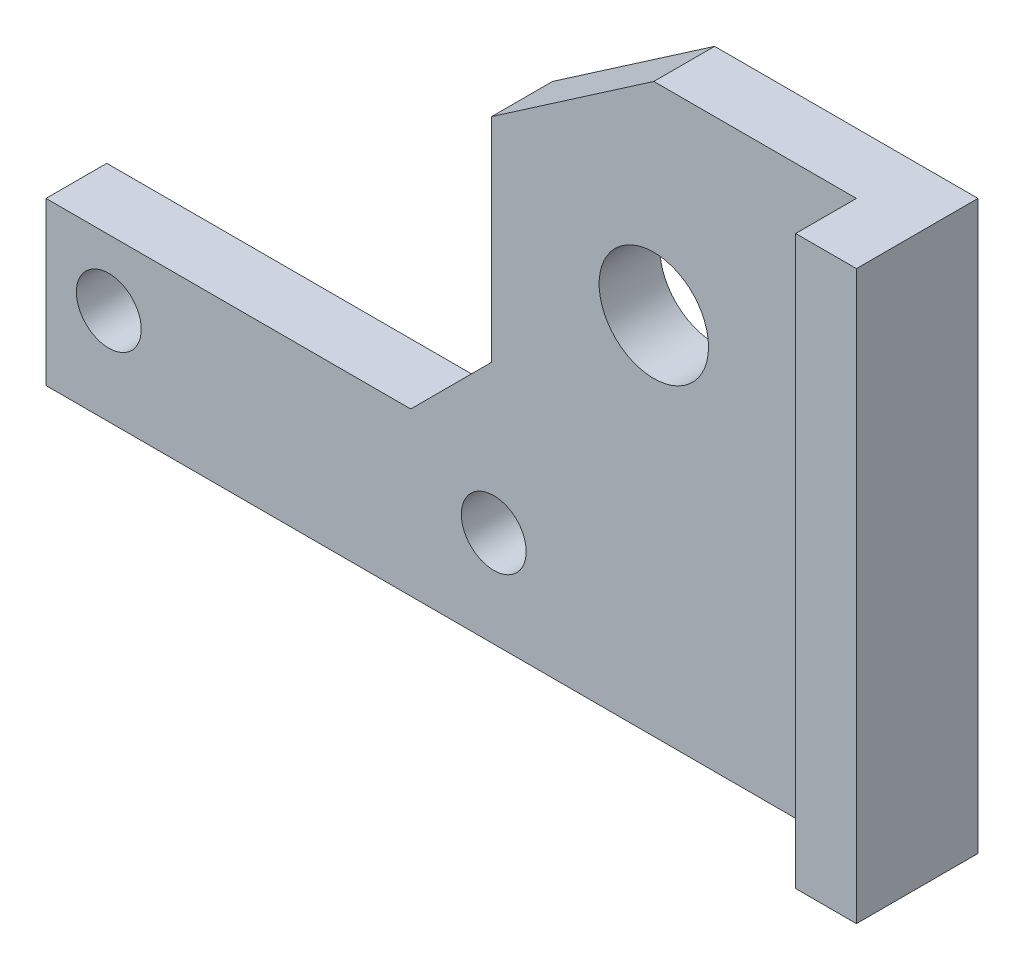
ISO-10303-21;
HEADER;
FILE_DESCRIPTION(('STEP AP214'),'2;1');
FILE_NAME('part.step','',(''),(''),'','','');
FILE_SCHEMA(('AUTOMOTIVE_DESIGN { 1 0 10303 214 1 1 1 1 }'));
ENDSEC;
DATA;
#1=APPLICATION_CONTEXT('core data for automotive mechanical design processes');
#2=APPLICATION_PROTOCOL_DEFINITION('international standard','automotive_design',2000,#1);
#3=PRODUCT_CONTEXT('',#1,'mechanical');
#4=PRODUCT('Part','Part','',(#3));
#5=PRODUCT_RELATED_PRODUCT_CATEGORY('part','',(#4));
#6=PRODUCT_DEFINITION_FORMATION('','',#4);
#7=PRODUCT_DEFINITION_CONTEXT('part definition',#1,'design');
#8=PRODUCT_DEFINITION('design','',#6,#7);
#9=PRODUCT_DEFINITION_SHAPE('','',#8);
#10=(LENGTH_UNIT() NAMED_UNIT(*) SI_UNIT(.MILLI.,.METRE.));
#11=(NAMED_UNIT(*) PLANE_ANGLE_UNIT() SI_UNIT($,.RADIAN.));
#12=(NAMED_UNIT(*) SI_UNIT($,.STERADIAN.) SOLID_ANGLE_UNIT());
#13=UNCERTAINTY_MEASURE_WITH_UNIT(LENGTH_MEASURE(1.E-05),#10,'distance_accuracy_value','');
#14=(GEOMETRIC_REPRESENTATION_CONTEXT(3) GLOBAL_UNCERTAINTY_ASSIGNED_CONTEXT((#13)) GLOBAL_UNIT_ASSIGNED_CONTEXT((#10,
#11,#12)) REPRESENTATION_CONTEXT('',''));
#15=CARTESIAN_POINT('',(0.,0.,0.));
#16=DIRECTION('',(0.,0.,1.));
#17=DIRECTION('',(1.,0.,0.));
#18=AXIS2_PLACEMENT_3D('',#15,#16,#17);
#19=CARTESIAN_POINT('',(0.,0.,3.));
#20=DIRECTION('',(0.,0.,-1.));
#21=DIRECTION('',(-1.,0.,0.));
#22=AXIS2_PLACEMENT_3D('',#19,#20,#21);
#23=PLANE('',#22);
#24=CARTESIAN_POINT('',(-39.9,4.75,3.));
#25=DIRECTION('',(0.,0.,1.));
#26=DIRECTION('',(1.,0.,0.));
#27=AXIS2_PLACEMENT_3D('',#24,#25,#26);
#28=CIRCLE('',#27,1.6);
#29=CARTESIAN_POINT('',(-38.3,4.75,3.));
#30=VERTEX_POINT('',#29);
#31=EDGE_CURVE('E260',#30,#30,#28,.T.);
#32=ORIENTED_EDGE('',*,*,#31,.F.);
#33=EDGE_LOOP('',(#32));
#34=FACE_BOUND('',#33,.T.);
#35=CARTESIAN_POINT('',(-13.,18.,3.));
#36=DIRECTION('',(0.,0.,1.));
#37=DIRECTION('',(1.,0.,0.));
#38=AXIS2_PLACEMENT_3D('',#35,#36,#37);
#39=CIRCLE('',#38,2.7);
#40=CARTESIAN_POINT('',(-10.3,18.,3.));
#41=VERTEX_POINT('',#40);
#42=EDGE_CURVE('E287',#41,#41,#39,.T.);
#43=ORIENTED_EDGE('',*,*,#42,.F.);
#44=EDGE_LOOP('',(#43));
#45=FACE_BOUND('',#44,.T.);
#46=CARTESIAN_POINT('',(-20.9,4.75,3.));
#47=DIRECTION('',(0.,0.,1.));
#48=DIRECTION('',(1.,0.,0.));
#49=AXIS2_PLACEMENT_3D('',#46,#47,#48);
#50=CIRCLE('',#49,1.6);
#51=CARTESIAN_POINT('',(-19.3,4.75,3.));
#52=VERTEX_POINT('',#51);
#53=EDGE_CURVE('E281',#52,#52,#50,.T.);
#54=ORIENTED_EDGE('',*,*,#53,.F.);
#55=EDGE_LOOP('',(#54));
#56=FACE_BOUND('',#55,.T.);
#57=DIRECTION('',(0.,-1.,0.));
#58=VECTOR('',#57,1.);
#59=CARTESIAN_POINT('',(-3.,0.,3.));
#60=LINE('',#59,#58);
#61=CARTESIAN_POINT('',(-3.,28.,3.));
#62=VERTEX_POINT('',#61);
#63=CARTESIAN_POINT('',(-3.,0.,3.));
#64=VERTEX_POINT('',#63);
#65=EDGE_CURVE('E140',#62,#64,#60,.T.);
#66=ORIENTED_EDGE('',*,*,#65,.F.);
#67=DIRECTION('',(1.,0.,0.));
#68=VECTOR('',#67,1.);
#69=CARTESIAN_POINT('',(-13.,28.,3.));
#70=LINE('',#69,#68);
#71=CARTESIAN_POINT('',(-13.,28.,3.));
#72=VERTEX_POINT('',#71);
#73=EDGE_CURVE('E264',#72,#62,#70,.T.);
#74=ORIENTED_EDGE('',*,*,#73,.F.);
#75=DIRECTION('',(-0.824041924199368,-0.566528822887065,0.));
#76=VECTOR('',#75,1.);
#77=CARTESIAN_POINT('',(-13.,28.,3.));
#78=LINE('',#77,#76);
#79=CARTESIAN_POINT('',(-21.,22.5,3.));
#80=VERTEX_POINT('',#79);
#81=EDGE_CURVE('E293',#72,#80,#78,.T.);
#82=ORIENTED_EDGE('',*,*,#81,.T.);
#83=DIRECTION('',(0.,1.,0.));
#84=VECTOR('',#83,1.);
#85=CARTESIAN_POINT('',(-21.,12.,3.));
#86=LINE('',#85,#84);
#87=CARTESIAN_POINT('',(-21.,12.,3.));
#88=VERTEX_POINT('',#87);
#89=EDGE_CURVE('E295',#88,#80,#86,.T.);
#90=ORIENTED_EDGE('',*,*,#89,.F.);
#91=DIRECTION('',(0.707106781186547,0.707106781186548,0.));
#92=VECTOR('',#91,1.);
#93=CARTESIAN_POINT('',(-25.,8.,3.));
#94=LINE('',#93,#92);
#95=CARTESIAN_POINT('',(-25.,8.,3.));
#96=VERTEX_POINT('',#95);
#97=EDGE_CURVE('E299',#96,#88,#94,.T.);
#98=ORIENTED_EDGE('',*,*,#97,.F.);
#99=DIRECTION('',(1.,0.,0.));
#100=VECTOR('',#99,1.);
#101=CARTESIAN_POINT('',(-43.,8.,3.));
#102=LINE('',#101,#100);
#103=CARTESIAN_POINT('',(-43.,8.,3.));
#104=VERTEX_POINT('',#103);
#105=EDGE_CURVE('E302',#104,#96,#102,.T.);
#106=ORIENTED_EDGE('',*,*,#105,.F.);
#107=DIRECTION('',(0.,1.,0.));
#108=VECTOR('',#107,1.);
#109=CARTESIAN_POINT('',(-43.,0.,3.));
#110=LINE('',#109,#108);
#111=CARTESIAN_POINT('',(-43.,0.,3.));
#112=VERTEX_POINT('',#111);
#113=EDGE_CURVE('E306',#112,#104,#110,.T.);
#114=ORIENTED_EDGE('',*,*,#113,.F.);
#115=DIRECTION('',(1.,0.,0.));
#116=VECTOR('',#115,1.);
#117=CARTESIAN_POINT('',(-43.,0.,3.));
#118=LINE('',#117,#116);
#119=EDGE_CURVE('E309',#112,#64,#118,.T.);
#120=ORIENTED_EDGE('',*,*,#119,.T.);
#121=EDGE_LOOP('',(#66,#74,#82,#90,#98,#106,#114,#120));
#122=FACE_BOUND('',#121,.T.);
#123=ADVANCED_FACE('F115',(#34,#45,#56,#122),#23,.F.);
#124=CARTESIAN_POINT('',(0.,0.,0.));
#125=DIRECTION('',(0.,0.,-1.));
#126=DIRECTION('',(-1.,0.,0.));
#127=AXIS2_PLACEMENT_3D('',#124,#125,#126);
#128=PLANE('',#127);
#129=DIRECTION('',(0.,1.,0.));
#130=VECTOR('',#129,1.);
#131=CARTESIAN_POINT('',(-16.5,0.,0.));
#132=LINE('',#131,#130);
#133=CARTESIAN_POINT('',(-16.5,0.,0.));
#134=VERTEX_POINT('',#133);
#135=CARTESIAN_POINT('',(-16.5,12.,0.));
#136=VERTEX_POINT('',#135);
#137=EDGE_CURVE('E392',#134,#136,#132,.T.);
#138=ORIENTED_EDGE('',*,*,#137,.F.);
#139=DIRECTION('',(1.,0.,0.));
#140=VECTOR('',#139,1.);
#141=CARTESIAN_POINT('',(-43.,0.,0.));
#142=LINE('',#141,#140);
#143=CARTESIAN_POINT('',(-43.,0.,0.));
#144=VERTEX_POINT('',#143);
#145=EDGE_CURVE('E238',#144,#134,#142,.T.);
#146=ORIENTED_EDGE('',*,*,#145,.F.);
#147=DIRECTION('',(0.,1.,0.));
#148=VECTOR('',#147,1.);
#149=CARTESIAN_POINT('',(-43.,0.,0.));
#150=LINE('',#149,#148);
#151=CARTESIAN_POINT('',(-43.,8.,0.));
#152=VERTEX_POINT('',#151);
#153=EDGE_CURVE('E336',#144,#152,#150,.T.);
#154=ORIENTED_EDGE('',*,*,#153,.T.);
#155=DIRECTION('',(1.,0.,0.));
#156=VECTOR('',#155,1.);
#157=CARTESIAN_POINT('',(-43.,8.,0.));
#158=LINE('',#157,#156);
#159=CARTESIAN_POINT('',(-25.,8.,0.));
#160=VERTEX_POINT('',#159);
#161=EDGE_CURVE('E339',#152,#160,#158,.T.);
#162=ORIENTED_EDGE('',*,*,#161,.T.);
#163=DIRECTION('',(0.707106781186547,0.707106781186548,0.));
#164=VECTOR('',#163,1.);
#165=CARTESIAN_POINT('',(-25.,8.,0.));
#166=LINE('',#165,#164);
#167=CARTESIAN_POINT('',(-21.,12.,0.));
#168=VERTEX_POINT('',#167);
#169=EDGE_CURVE('E342',#160,#168,#166,.T.);
#170=ORIENTED_EDGE('',*,*,#169,.T.);
#171=DIRECTION('',(0.,1.,0.));
#172=VECTOR('',#171,1.);
#173=CARTESIAN_POINT('',(-21.,12.,0.));
#174=LINE('',#173,#172);
#175=CARTESIAN_POINT('',(-21.,22.5,0.));
#176=VERTEX_POINT('',#175);
#177=EDGE_CURVE('E345',#168,#176,#174,.T.);
#178=ORIENTED_EDGE('',*,*,#177,.T.);
#179=DIRECTION('',(-0.824041924199368,-0.566528822887065,0.));
#180=VECTOR('',#179,1.);
#181=CARTESIAN_POINT('',(-13.,28.,0.));
#182=LINE('',#181,#180);
#183=CARTESIAN_POINT('',(-13.,28.,0.));
#184=VERTEX_POINT('',#183);
#185=EDGE_CURVE('E290',#184,#176,#182,.T.);
#186=ORIENTED_EDGE('',*,*,#185,.F.);
#187=DIRECTION('',(1.,0.,0.));
#188=VECTOR('',#187,1.);
#189=CARTESIAN_POINT('',(-13.,28.,0.));
#190=LINE('',#189,#188);
#191=CARTESIAN_POINT('',(0.,28.,0.));
#192=VERTEX_POINT('',#191);
#193=EDGE_CURVE('E296',#184,#192,#190,.T.);
#194=ORIENTED_EDGE('',*,*,#193,.T.);
#195=DIRECTION('',(0.,1.,0.));
#196=VECTOR('',#195,1.);
#197=CARTESIAN_POINT('',(0.,0.,0.));
#198=LINE('',#197,#196);
#199=CARTESIAN_POINT('',(0.,0.,0.));
#200=VERTEX_POINT('',#199);
#201=EDGE_CURVE('E331',#200,#192,#198,.T.);
#202=ORIENTED_EDGE('',*,*,#201,.F.);
#203=CARTESIAN_POINT('',(-13.5,0.,0.));
#204=VERTEX_POINT('',#203);
#205=EDGE_CURVE('E335',#204,#200,#142,.T.);
#206=ORIENTED_EDGE('',*,*,#205,.F.);
#207=DIRECTION('',(0.,-1.,0.));
#208=VECTOR('',#207,1.);
#209=CARTESIAN_POINT('',(-13.5,0.,0.));
#210=LINE('',#209,#208);
#211=CARTESIAN_POINT('',(-13.5,12.,0.));
#212=VERTEX_POINT('',#211);
#213=EDGE_CURVE('E388',#212,#204,#210,.T.);
#214=ORIENTED_EDGE('',*,*,#213,.F.);
#215=DIRECTION('',(1.,0.,0.));
#216=VECTOR('',#215,1.);
#217=CARTESIAN_POINT('',(0.,12.,0.));
#218=LINE('',#217,#216);
#219=EDGE_CURVE('E233',#136,#212,#218,.T.);
#220=ORIENTED_EDGE('',*,*,#219,.F.);
#221=EDGE_LOOP('',(#138,#146,#154,#162,#170,#178,#186,#194,#202,#206,#214,#220));
#222=FACE_BOUND('',#221,.T.);
#223=CARTESIAN_POINT('',(-20.9,4.75,0.));
#224=DIRECTION('',(0.,0.,1.));
#225=DIRECTION('',(1.,0.,0.));
#226=AXIS2_PLACEMENT_3D('',#223,#224,#225);
#227=CIRCLE('',#226,1.6);
#228=CARTESIAN_POINT('',(-19.3,4.75,0.));
#229=VERTEX_POINT('',#228);
#230=EDGE_CURVE('E279',#229,#229,#227,.T.);
#231=ORIENTED_EDGE('',*,*,#230,.T.);
#232=EDGE_LOOP('',(#231));
#233=FACE_BOUND('',#232,.T.);
#234=CARTESIAN_POINT('',(-13.,18.,0.));
#235=DIRECTION('',(0.,0.,1.));
#236=DIRECTION('',(1.,0.,0.));
#237=AXIS2_PLACEMENT_3D('',#234,#235,#236);
#238=CIRCLE('',#237,2.7);
#239=CARTESIAN_POINT('',(-10.3,18.,0.));
#240=VERTEX_POINT('',#239);
#241=EDGE_CURVE('E284',#240,#240,#238,.T.);
#242=ORIENTED_EDGE('',*,*,#241,.T.);
#243=EDGE_LOOP('',(#242));
#244=FACE_BOUND('',#243,.T.);
#245=CARTESIAN_POINT('',(-39.9,4.75,0.));
#246=DIRECTION('',(0.,0.,1.));
#247=DIRECTION('',(1.,0.,0.));
#248=AXIS2_PLACEMENT_3D('',#245,#246,#247);
#249=CIRCLE('',#248,1.6);
#250=CARTESIAN_POINT('',(-38.3,4.75,0.));
#251=VERTEX_POINT('',#250);
#252=EDGE_CURVE('E272',#251,#251,#249,.T.);
#253=ORIENTED_EDGE('',*,*,#252,.T.);
#254=EDGE_LOOP('',(#253));
#255=FACE_BOUND('',#254,.T.);
#256=ADVANCED_FACE('F355',(#222,#233,#244,#255),#128,.T.);
#257=CARTESIAN_POINT('',(-13.,28.,3.));
#258=DIRECTION('',(0.566528822887065,-0.824041924199368,0.));
#259=DIRECTION('',(0.824041924199368,0.566528822887065,0.));
#260=AXIS2_PLACEMENT_3D('',#257,#258,#259);
#261=PLANE('',#260);
#262=ORIENTED_EDGE('',*,*,#185,.T.);
#263=DIRECTION('',(0.,0.,-1.));
#264=VECTOR('',#263,1.);
#265=CARTESIAN_POINT('',(-21.,22.5,3.));
#266=LINE('',#265,#264);
#267=EDGE_CURVE('E12',#80,#176,#266,.T.);
#268=ORIENTED_EDGE('',*,*,#267,.F.);
#269=ORIENTED_EDGE('',*,*,#81,.F.);
#270=DIRECTION('',(0.,0.,-1.));
#271=VECTOR('',#270,1.);
#272=CARTESIAN_POINT('',(-13.,28.,3.));
#273=LINE('',#272,#271);
#274=EDGE_CURVE('E326',#72,#184,#273,.T.);
#275=ORIENTED_EDGE('',*,*,#274,.T.);
#276=EDGE_LOOP('',(#262,#268,#269,#275));
#277=FACE_BOUND('',#276,.T.);
#278=ADVANCED_FACE('F117',(#277),#261,.F.);
#279=CARTESIAN_POINT('',(-21.,12.,3.));
#280=DIRECTION('',(-1.,0.,0.));
#281=DIRECTION('',(0.,0.,1.));
#282=AXIS2_PLACEMENT_3D('',#279,#280,#281);
#283=PLANE('',#282);
#284=ORIENTED_EDGE('',*,*,#177,.F.);
#285=DIRECTION('',(0.,0.,-1.));
#286=VECTOR('',#285,1.);
#287=CARTESIAN_POINT('',(-21.,12.,3.));
#288=LINE('',#287,#286);
#289=EDGE_CURVE('E124',#88,#168,#288,.T.);
#290=ORIENTED_EDGE('',*,*,#289,.F.);
#291=ORIENTED_EDGE('',*,*,#89,.T.);
#292=ORIENTED_EDGE('',*,*,#267,.T.);
#293=EDGE_LOOP('',(#284,#290,#291,#292));
#294=FACE_BOUND('',#293,.T.);
#295=ADVANCED_FACE('F359',(#294),#283,.T.);
#296=CARTESIAN_POINT('',(-25.,8.,3.));
#297=DIRECTION('',(-0.707106781186548,0.707106781186547,0.));
#298=DIRECTION('',(-0.707106781186547,-0.707106781186548,0.));
#299=AXIS2_PLACEMENT_3D('',#296,#297,#298);
#300=PLANE('',#299);
#301=ORIENTED_EDGE('',*,*,#169,.F.);
#302=DIRECTION('',(0.,0.,-1.));
#303=VECTOR('',#302,1.);
#304=CARTESIAN_POINT('',(-25.,8.,3.));
#305=LINE('',#304,#303);
#306=EDGE_CURVE('E315',#96,#160,#305,.T.);
#307=ORIENTED_EDGE('',*,*,#306,.F.);
#308=ORIENTED_EDGE('',*,*,#97,.T.);
#309=ORIENTED_EDGE('',*,*,#289,.T.);
#310=EDGE_LOOP('',(#301,#307,#308,#309));
#311=FACE_BOUND('',#310,.T.);
#312=ADVANCED_FACE('F364',(#311),#300,.T.);
#313=CARTESIAN_POINT('',(-43.,8.,3.));
#314=DIRECTION('',(0.,1.,0.));
#315=DIRECTION('',(0.,0.,1.));
#316=AXIS2_PLACEMENT_3D('',#313,#314,#315);
#317=PLANE('',#316);
#318=ORIENTED_EDGE('',*,*,#161,.F.);
#319=DIRECTION('',(0.,0.,-1.));
#320=VECTOR('',#319,1.);
#321=CARTESIAN_POINT('',(-43.,8.,3.));
#322=LINE('',#321,#320);
#323=EDGE_CURVE('E317',#104,#152,#322,.T.);
#324=ORIENTED_EDGE('',*,*,#323,.F.);
#325=ORIENTED_EDGE('',*,*,#105,.T.);
#326=ORIENTED_EDGE('',*,*,#306,.T.);
#327=EDGE_LOOP('',(#318,#324,#325,#326));
#328=FACE_BOUND('',#327,.T.);
#329=ADVANCED_FACE('F367',(#328),#317,.T.);
#330=CARTESIAN_POINT('',(-43.,0.,3.));
#331=DIRECTION('',(-1.,0.,0.));
#332=DIRECTION('',(0.,-1.,0.));
#333=AXIS2_PLACEMENT_3D('',#330,#331,#332);
#334=PLANE('',#333);
#335=ORIENTED_EDGE('',*,*,#153,.F.);
#336=DIRECTION('',(0.,0.,-1.));
#337=VECTOR('',#336,1.);
#338=CARTESIAN_POINT('',(-43.,0.,3.));
#339=LINE('',#338,#337);
#340=EDGE_CURVE('E319',#112,#144,#339,.T.);
#341=ORIENTED_EDGE('',*,*,#340,.F.);
#342=ORIENTED_EDGE('',*,*,#113,.T.);
#343=ORIENTED_EDGE('',*,*,#323,.T.);
#344=EDGE_LOOP('',(#335,#341,#342,#343));
#345=FACE_BOUND('',#344,.T.);
#346=ADVANCED_FACE('F371',(#345),#334,.T.);
#347=CARTESIAN_POINT('',(-43.,0.,3.));
#348=DIRECTION('',(0.,1.,0.));
#349=DIRECTION('',(0.,0.,1.));
#350=AXIS2_PLACEMENT_3D('',#347,#348,#349);
#351=PLANE('',#350);
#352=ORIENTED_EDGE('',*,*,#145,.T.);
#353=DIRECTION('',(0.,0.,-1.));
#354=VECTOR('',#353,1.);
#355=CARTESIAN_POINT('',(-16.5,0.,1.25));
#356=LINE('',#355,#354);
#357=CARTESIAN_POINT('',(-16.5,0.,1.25));
#358=VERTEX_POINT('',#357);
#359=EDGE_CURVE('E230',#358,#134,#356,.T.);
#360=ORIENTED_EDGE('',*,*,#359,.F.);
#361=DIRECTION('',(1.,0.,0.));
#362=VECTOR('',#361,1.);
#363=CARTESIAN_POINT('',(0.,0.,1.25));
#364=LINE('',#363,#362);
#365=CARTESIAN_POINT('',(-13.5,0.,1.25));
#366=VERTEX_POINT('',#365);
#367=EDGE_CURVE('E218',#358,#366,#364,.T.);
#368=ORIENTED_EDGE('',*,*,#367,.T.);
#369=DIRECTION('',(0.,0.,-1.));
#370=VECTOR('',#369,1.);
#371=CARTESIAN_POINT('',(-13.5,0.,1.25));
#372=LINE('',#371,#370);
#373=EDGE_CURVE('E239',#366,#204,#372,.T.);
#374=ORIENTED_EDGE('',*,*,#373,.T.);
#375=ORIENTED_EDGE('',*,*,#205,.T.);
#376=DIRECTION('',(0.,0.,-1.));
#377=VECTOR('',#376,1.);
#378=CARTESIAN_POINT('',(0.,0.,3.));
#379=LINE('',#378,#377);
#380=CARTESIAN_POINT('',(0.,0.,6.));
#381=VERTEX_POINT('',#380);
#382=EDGE_CURVE('E321',#381,#200,#379,.T.);
#383=ORIENTED_EDGE('',*,*,#382,.F.);
#384=DIRECTION('',(1.,0.,0.));
#385=VECTOR('',#384,1.);
#386=CARTESIAN_POINT('',(0.,0.,6.));
#387=LINE('',#386,#385);
#388=CARTESIAN_POINT('',(-3.,0.,6.));
#389=VERTEX_POINT('',#388);
#390=EDGE_CURVE('E254',#389,#381,#387,.T.);
#391=ORIENTED_EDGE('',*,*,#390,.F.);
#392=DIRECTION('',(0.,0.,-1.));
#393=VECTOR('',#392,1.);
#394=CARTESIAN_POINT('',(-3.,0.,6.));
#395=LINE('',#394,#393);
#396=EDGE_CURVE('E257',#389,#64,#395,.T.);
#397=ORIENTED_EDGE('',*,*,#396,.T.);
#398=ORIENTED_EDGE('',*,*,#119,.F.);
#399=ORIENTED_EDGE('',*,*,#340,.T.);
#400=EDGE_LOOP('',(#352,#360,#368,#374,#375,#383,#391,#397,#398,#399));
#401=FACE_BOUND('',#400,.T.);
#402=ADVANCED_FACE('F236',(#401),#351,.F.);
#403=CARTESIAN_POINT('',(0.,0.,3.));
#404=DIRECTION('',(-1.,0.,0.));
#405=DIRECTION('',(0.,0.,1.));
#406=AXIS2_PLACEMENT_3D('',#403,#404,#405);
#407=PLANE('',#406);
#408=ORIENTED_EDGE('',*,*,#201,.T.);
#409=DIRECTION('',(0.,0.,-1.));
#410=VECTOR('',#409,1.);
#411=CARTESIAN_POINT('',(0.,28.,3.));
#412=LINE('',#411,#410);
#413=CARTESIAN_POINT('',(0.,28.,6.));
#414=VERTEX_POINT('',#413);
#415=EDGE_CURVE('E324',#414,#192,#412,.T.);
#416=ORIENTED_EDGE('',*,*,#415,.F.);
#417=DIRECTION('',(0.,1.,0.));
#418=VECTOR('',#417,1.);
#419=CARTESIAN_POINT('',(0.,0.,6.));
#420=LINE('',#419,#418);
#421=EDGE_CURVE('E241',#381,#414,#420,.T.);
#422=ORIENTED_EDGE('',*,*,#421,.F.);
#423=ORIENTED_EDGE('',*,*,#382,.T.);
#424=EDGE_LOOP('',(#408,#416,#422,#423));
#425=FACE_BOUND('',#424,.T.);
#426=ADVANCED_FACE('F381',(#425),#407,.F.);
#427=CARTESIAN_POINT('',(-13.,28.,3.));
#428=DIRECTION('',(0.,1.,0.));
#429=DIRECTION('',(0.,0.,1.));
#430=AXIS2_PLACEMENT_3D('',#427,#428,#429);
#431=PLANE('',#430);
#432=ORIENTED_EDGE('',*,*,#193,.F.);
#433=ORIENTED_EDGE('',*,*,#274,.F.);
#434=ORIENTED_EDGE('',*,*,#73,.T.);
#435=DIRECTION('',(0.,0.,-1.));
#436=VECTOR('',#435,1.);
#437=CARTESIAN_POINT('',(-3.,28.,6.));
#438=LINE('',#437,#436);
#439=CARTESIAN_POINT('',(-3.,28.,6.));
#440=VERTEX_POINT('',#439);
#441=EDGE_CURVE('E269',#440,#62,#438,.T.);
#442=ORIENTED_EDGE('',*,*,#441,.F.);
#443=DIRECTION('',(1.,0.,0.));
#444=VECTOR('',#443,1.);
#445=CARTESIAN_POINT('',(0.,28.,6.));
#446=LINE('',#445,#444);
#447=EDGE_CURVE('E249',#440,#414,#446,.T.);
#448=ORIENTED_EDGE('',*,*,#447,.T.);
#449=ORIENTED_EDGE('',*,*,#415,.T.);
#450=EDGE_LOOP('',(#432,#433,#434,#442,#448,#449));
#451=FACE_BOUND('',#450,.T.);
#452=ADVANCED_FACE('F384',(#451),#431,.T.);
#453=CARTESIAN_POINT('',(-13.,18.,3.));
#454=DIRECTION('',(0.,0.,-1.));
#455=DIRECTION('',(-1.,0.,0.));
#456=AXIS2_PLACEMENT_3D('',#453,#454,#455);
#457=CYLINDRICAL_SURFACE('',#456,2.7);
#458=ORIENTED_EDGE('',*,*,#42,.T.);
#459=EDGE_LOOP('',(#458));
#460=FACE_BOUND('',#459,.T.);
#461=ORIENTED_EDGE('',*,*,#241,.F.);
#462=EDGE_LOOP('',(#461));
#463=FACE_BOUND('',#462,.T.);
#464=ADVANCED_FACE('F420',(#460,#463),#457,.F.);
#465=CARTESIAN_POINT('',(-20.9,4.75,3.));
#466=DIRECTION('',(0.,0.,-1.));
#467=DIRECTION('',(-1.,0.,0.));
#468=AXIS2_PLACEMENT_3D('',#465,#466,#467);
#469=CYLINDRICAL_SURFACE('',#468,1.6);
#470=ORIENTED_EDGE('',*,*,#53,.T.);
#471=EDGE_LOOP('',(#470));
#472=FACE_BOUND('',#471,.T.);
#473=ORIENTED_EDGE('',*,*,#230,.F.);
#474=EDGE_LOOP('',(#473));
#475=FACE_BOUND('',#474,.T.);
#476=ADVANCED_FACE('F464',(#472,#475),#469,.F.);
#477=CARTESIAN_POINT('',(-39.9,4.75,3.));
#478=DIRECTION('',(0.,0.,-1.));
#479=DIRECTION('',(-1.,0.,0.));
#480=AXIS2_PLACEMENT_3D('',#477,#478,#479);
#481=CYLINDRICAL_SURFACE('',#480,1.6);
#482=ORIENTED_EDGE('',*,*,#31,.T.);
#483=EDGE_LOOP('',(#482));
#484=FACE_BOUND('',#483,.T.);
#485=ORIENTED_EDGE('',*,*,#252,.F.);
#486=EDGE_LOOP('',(#485));
#487=FACE_BOUND('',#486,.T.);
#488=ADVANCED_FACE('F460',(#484,#487),#481,.F.);
#489=CARTESIAN_POINT('',(-3.,0.,6.));
#490=DIRECTION('',(1.,0.,0.));
#491=DIRECTION('',(0.,0.,-1.));
#492=AXIS2_PLACEMENT_3D('',#489,#490,#491);
#493=PLANE('',#492);
#494=ORIENTED_EDGE('',*,*,#65,.T.);
#495=ORIENTED_EDGE('',*,*,#396,.F.);
#496=DIRECTION('',(0.,-1.,0.));
#497=VECTOR('',#496,1.);
#498=CARTESIAN_POINT('',(-3.,0.,6.));
#499=LINE('',#498,#497);
#500=EDGE_CURVE('E252',#440,#389,#499,.T.);
#501=ORIENTED_EDGE('',*,*,#500,.F.);
#502=ORIENTED_EDGE('',*,*,#441,.T.);
#503=EDGE_LOOP('',(#494,#495,#501,#502));
#504=FACE_BOUND('',#503,.T.);
#505=ADVANCED_FACE('F375',(#504),#493,.F.);
#506=CARTESIAN_POINT('',(0.,0.,6.));
#507=DIRECTION('',(0.,0.,-1.));
#508=DIRECTION('',(-1.,0.,0.));
#509=AXIS2_PLACEMENT_3D('',#506,#507,#508);
#510=PLANE('',#509);
#511=ORIENTED_EDGE('',*,*,#421,.T.);
#512=ORIENTED_EDGE('',*,*,#447,.F.);
#513=ORIENTED_EDGE('',*,*,#500,.T.);
#514=ORIENTED_EDGE('',*,*,#390,.T.);
#515=EDGE_LOOP('',(#511,#512,#513,#514));
#516=FACE_BOUND('',#515,.T.);
#517=ADVANCED_FACE('F379',(#516),#510,.F.);
#518=CARTESIAN_POINT('',(-16.5,0.,1.25));
#519=DIRECTION('',(-1.,0.,0.));
#520=DIRECTION('',(0.,0.,1.));
#521=AXIS2_PLACEMENT_3D('',#518,#519,#520);
#522=PLANE('',#521);
#523=ORIENTED_EDGE('',*,*,#137,.T.);
#524=DIRECTION('',(0.,0.,-1.));
#525=VECTOR('',#524,1.);
#526=CARTESIAN_POINT('',(-16.5,12.,1.25));
#527=LINE('',#526,#525);
#528=CARTESIAN_POINT('',(-16.5,12.,1.25));
#529=VERTEX_POINT('',#528);
#530=EDGE_CURVE('E232',#529,#136,#527,.T.);
#531=ORIENTED_EDGE('',*,*,#530,.F.);
#532=DIRECTION('',(0.,1.,0.));
#533=VECTOR('',#532,1.);
#534=CARTESIAN_POINT('',(-16.5,0.,1.25));
#535=LINE('',#534,#533);
#536=EDGE_CURVE('E221',#358,#529,#535,.T.);
#537=ORIENTED_EDGE('',*,*,#536,.F.);
#538=ORIENTED_EDGE('',*,*,#359,.T.);
#539=EDGE_LOOP('',(#523,#531,#537,#538));
#540=FACE_BOUND('',#539,.T.);
#541=ADVANCED_FACE('F229',(#540),#522,.F.);
#542=CARTESIAN_POINT('',(-13.5,0.,1.25));
#543=DIRECTION('',(1.,0.,0.));
#544=DIRECTION('',(0.,1.,0.));
#545=AXIS2_PLACEMENT_3D('',#542,#543,#544);
#546=PLANE('',#545);
#547=ORIENTED_EDGE('',*,*,#213,.T.);
#548=ORIENTED_EDGE('',*,*,#373,.F.);
#549=DIRECTION('',(0.,-1.,0.));
#550=VECTOR('',#549,1.);
#551=CARTESIAN_POINT('',(-13.5,0.,1.25));
#552=LINE('',#551,#550);
#553=CARTESIAN_POINT('',(-13.5,12.,1.25));
#554=VERTEX_POINT('',#553);
#555=EDGE_CURVE('E132',#554,#366,#552,.T.);
#556=ORIENTED_EDGE('',*,*,#555,.F.);
#557=DIRECTION('',(0.,0.,-1.));
#558=VECTOR('',#557,1.);
#559=CARTESIAN_POINT('',(-13.5,12.,1.25));
#560=LINE('',#559,#558);
#561=EDGE_CURVE('E243',#554,#212,#560,.T.);
#562=ORIENTED_EDGE('',*,*,#561,.T.);
#563=EDGE_LOOP('',(#547,#548,#556,#562));
#564=FACE_BOUND('',#563,.T.);
#565=ADVANCED_FACE('F390',(#564),#546,.F.);
#566=CARTESIAN_POINT('',(0.,12.,1.25));
#567=DIRECTION('',(0.,1.,0.));
#568=DIRECTION('',(-1.,0.,0.));
#569=AXIS2_PLACEMENT_3D('',#566,#567,#568);
#570=PLANE('',#569);
#571=ORIENTED_EDGE('',*,*,#219,.T.);
#572=ORIENTED_EDGE('',*,*,#561,.F.);
#573=DIRECTION('',(1.,0.,0.));
#574=VECTOR('',#573,1.);
#575=CARTESIAN_POINT('',(0.,12.,1.25));
#576=LINE('',#575,#574);
#577=EDGE_CURVE('E398',#529,#554,#576,.T.);
#578=ORIENTED_EDGE('',*,*,#577,.F.);
#579=ORIENTED_EDGE('',*,*,#530,.T.);
#580=EDGE_LOOP('',(#571,#572,#578,#579));
#581=FACE_BOUND('',#580,.T.);
#582=ADVANCED_FACE('F401',(#581),#570,.F.);
#583=CARTESIAN_POINT('',(0.,0.,1.25));
#584=DIRECTION('',(0.,0.,1.));
#585=DIRECTION('',(1.,0.,0.));
#586=AXIS2_PLACEMENT_3D('',#583,#584,#585);
#587=PLANE('',#586);
#588=ORIENTED_EDGE('',*,*,#536,.T.);
#589=ORIENTED_EDGE('',*,*,#577,.T.);
#590=ORIENTED_EDGE('',*,*,#555,.T.);
#591=ORIENTED_EDGE('',*,*,#367,.F.);
#592=EDGE_LOOP('',(#588,#589,#590,#591));
#593=FACE_BOUND('',#592,.T.);
#594=ADVANCED_FACE('F220',(#593),#587,.F.);
#595=CLOSED_SHELL('',(#123,#256,#278,#295,#312,#329,#346,#402,#426,#452,#464,#476,#488,#505,
#517,#541,#565,#582,#594));
#596=MANIFOLD_SOLID_BREP('B2',#595);
#597=ADVANCED_BREP_SHAPE_REPRESENTATION('',(#18,#596),#14);
#598=SHAPE_DEFINITION_REPRESENTATION(#9,#597);
ENDSEC;
END-ISO-10303-21;
